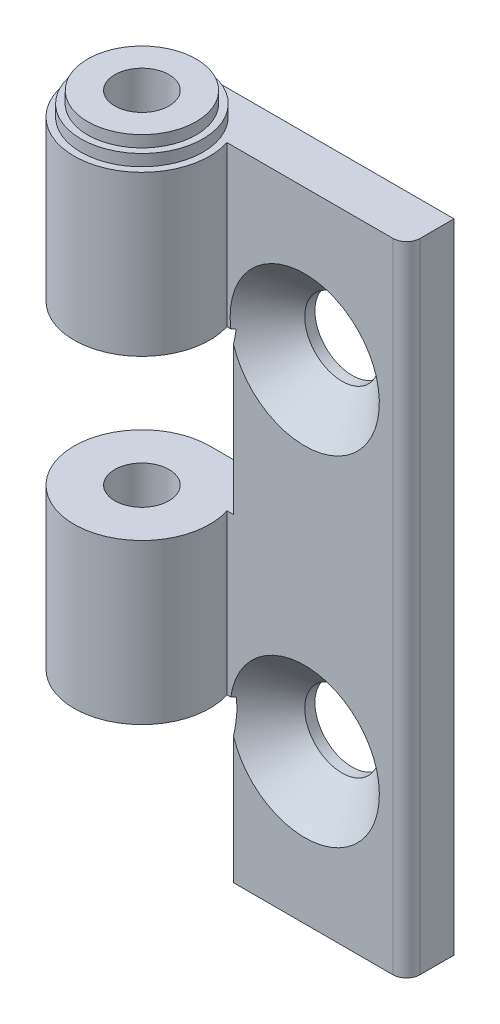
ISO-10303-21;
HEADER;
FILE_DESCRIPTION(('STEP AP214'),'2;1');
FILE_NAME('part.step','',(''),(''),'','','');
FILE_SCHEMA(('AUTOMOTIVE_DESIGN { 1 0 10303 214 1 1 1 1 }'));
ENDSEC;
DATA;
#1=APPLICATION_CONTEXT('core data for automotive mechanical design processes');
#2=APPLICATION_PROTOCOL_DEFINITION('international standard','automotive_design',2000,#1);
#3=PRODUCT_CONTEXT('',#1,'mechanical');
#4=PRODUCT('Part','Part','',(#3));
#5=PRODUCT_RELATED_PRODUCT_CATEGORY('part','',(#4));
#6=PRODUCT_DEFINITION_FORMATION('','',#4);
#7=PRODUCT_DEFINITION_CONTEXT('part definition',#1,'design');
#8=PRODUCT_DEFINITION('design','',#6,#7);
#9=PRODUCT_DEFINITION_SHAPE('','',#8);
#10=(LENGTH_UNIT() NAMED_UNIT(*) SI_UNIT(.MILLI.,.METRE.));
#11=(NAMED_UNIT(*) PLANE_ANGLE_UNIT() SI_UNIT($,.RADIAN.));
#12=(NAMED_UNIT(*) SI_UNIT($,.STERADIAN.) SOLID_ANGLE_UNIT());
#13=UNCERTAINTY_MEASURE_WITH_UNIT(LENGTH_MEASURE(1.E-05),#10,'distance_accuracy_value','');
#14=(GEOMETRIC_REPRESENTATION_CONTEXT(3) GLOBAL_UNCERTAINTY_ASSIGNED_CONTEXT((#13)) GLOBAL_UNIT_ASSIGNED_CONTEXT((#10,
#11,#12)) REPRESENTATION_CONTEXT('',''));
#15=CARTESIAN_POINT('',(0.,0.,0.));
#16=DIRECTION('',(0.,0.,1.));
#17=DIRECTION('',(1.,0.,0.));
#18=AXIS2_PLACEMENT_3D('',#15,#16,#17);
#19=CARTESIAN_POINT('',(0.,23.5,0.));
#20=DIRECTION('',(0.,-1.,0.));
#21=DIRECTION('',(0.,0.,-1.));
#22=AXIS2_PLACEMENT_3D('',#19,#20,#21);
#23=PLANE('',#22);
#24=CARTESIAN_POINT('',(0.,23.5,0.));
#25=DIRECTION('',(0.,-1.,0.));
#26=DIRECTION('',(0.,0.,-1.));
#27=AXIS2_PLACEMENT_3D('',#24,#25,#26);
#28=CIRCLE('',#27,4.5);
#29=CARTESIAN_POINT('',(0.,23.5,-4.5));
#30=VERTEX_POINT('',#29);
#31=EDGE_CURVE('E195',#30,#30,#28,.F.);
#32=ORIENTED_EDGE('',*,*,#31,.F.);
#33=EDGE_LOOP('',(#32));
#34=FACE_BOUND('',#33,.T.);
#35=CARTESIAN_POINT('',(17.0000000000007,23.5,-2.49999999999931));
#36=DIRECTION('',(0.,-1.,0.));
#37=DIRECTION('',(0.,0.,-1.));
#38=AXIS2_PLACEMENT_3D('',#35,#36,#37);
#39=CIRCLE('',#38,0.999999999999304);
#40=CARTESIAN_POINT('',(18.,23.5,-2.5));
#41=VERTEX_POINT('',#40);
#42=CARTESIAN_POINT('',(17.,23.5,-1.5));
#43=VERTEX_POINT('',#42);
#44=EDGE_CURVE('E131',#41,#43,#39,.T.);
#45=ORIENTED_EDGE('',*,*,#44,.F.);
#46=DIRECTION('',(0.,0.,-1.));
#47=VECTOR('',#46,1.);
#48=CARTESIAN_POINT('',(18.,23.5,-1.5));
#49=LINE('',#48,#47);
#50=CARTESIAN_POINT('',(18.,23.5,-5.));
#51=VERTEX_POINT('',#50);
#52=EDGE_CURVE('E152',#41,#51,#49,.T.);
#53=ORIENTED_EDGE('',*,*,#52,.T.);
#54=DIRECTION('',(-1.,0.,0.));
#55=VECTOR('',#54,1.);
#56=CARTESIAN_POINT('',(18.,23.5,-5.));
#57=LINE('',#56,#55);
#58=CARTESIAN_POINT('',(0.,23.5,-5.));
#59=VERTEX_POINT('',#58);
#60=EDGE_CURVE('E160',#51,#59,#57,.T.);
#61=ORIENTED_EDGE('',*,*,#60,.T.);
#62=CARTESIAN_POINT('',(0.,23.5,0.));
#63=DIRECTION('',(0.,1.,0.));
#64=DIRECTION('',(0.,0.,1.));
#65=AXIS2_PLACEMENT_3D('',#62,#63,#64);
#66=CIRCLE('',#65,5.);
#67=CARTESIAN_POINT('',(4.76969600708473,23.5,-1.5));
#68=VERTEX_POINT('',#67);
#69=EDGE_CURVE('E177',#59,#68,#66,.T.);
#70=ORIENTED_EDGE('',*,*,#69,.T.);
#71=DIRECTION('',(-1.,0.,0.));
#72=VECTOR('',#71,1.);
#73=CARTESIAN_POINT('',(18.,23.5,-1.5));
#74=LINE('',#73,#72);
#75=EDGE_CURVE('E153',#43,#68,#74,.T.);
#76=ORIENTED_EDGE('',*,*,#75,.F.);
#77=EDGE_LOOP('',(#45,#53,#61,#70,#76));
#78=FACE_BOUND('',#77,.T.);
#79=ADVANCED_FACE('F32',(#34,#78),#23,.F.);
#80=CARTESIAN_POINT('',(5.,-23.5,0.));
#81=DIRECTION('',(0.,1.,0.));
#82=DIRECTION('',(0.,0.,1.));
#83=AXIS2_PLACEMENT_3D('',#80,#81,#82);
#84=PLANE('',#83);
#85=CARTESIAN_POINT('',(17.0000000000007,-23.5,-2.49999999999931));
#86=DIRECTION('',(0.,-1.,0.));
#87=DIRECTION('',(0.,0.,-1.));
#88=AXIS2_PLACEMENT_3D('',#85,#86,#87);
#89=CIRCLE('',#88,0.999999999999304);
#90=CARTESIAN_POINT('',(18.,-23.5,-2.5));
#91=VERTEX_POINT('',#90);
#92=CARTESIAN_POINT('',(17.,-23.5,-1.5));
#93=VERTEX_POINT('',#92);
#94=EDGE_CURVE('E51',#91,#93,#89,.T.);
#95=ORIENTED_EDGE('',*,*,#94,.T.);
#96=DIRECTION('',(1.,0.,0.));
#97=VECTOR('',#96,1.);
#98=CARTESIAN_POINT('',(0.,-23.5,-1.5));
#99=LINE('',#98,#97);
#100=CARTESIAN_POINT('',(5.25,-23.5,-1.5));
#101=VERTEX_POINT('',#100);
#102=EDGE_CURVE('E143',#101,#93,#99,.T.);
#103=ORIENTED_EDGE('',*,*,#102,.F.);
#104=DIRECTION('',(0.,0.,-1.));
#105=VECTOR('',#104,1.);
#106=CARTESIAN_POINT('',(5.25,-23.5,47.));
#107=LINE('',#106,#105);
#108=CARTESIAN_POINT('',(5.25,-23.5,-5.));
#109=VERTEX_POINT('',#108);
#110=EDGE_CURVE('E251',#101,#109,#107,.T.);
#111=ORIENTED_EDGE('',*,*,#110,.T.);
#112=DIRECTION('',(1.,0.,0.));
#113=VECTOR('',#112,1.);
#114=CARTESIAN_POINT('',(0.,-23.5,-5.));
#115=LINE('',#114,#113);
#116=CARTESIAN_POINT('',(18.,-23.5,-5.));
#117=VERTEX_POINT('',#116);
#118=EDGE_CURVE('E168',#109,#117,#115,.T.);
#119=ORIENTED_EDGE('',*,*,#118,.T.);
#120=DIRECTION('',(0.,0.,-1.));
#121=VECTOR('',#120,1.);
#122=CARTESIAN_POINT('',(18.,-23.5,-1.5));
#123=LINE('',#122,#121);
#124=EDGE_CURVE('E145',#91,#117,#123,.T.);
#125=ORIENTED_EDGE('',*,*,#124,.F.);
#126=EDGE_LOOP('',(#95,#103,#111,#119,#125));
#127=FACE_BOUND('',#126,.T.);
#128=ADVANCED_FACE('F141',(#127),#84,.F.);
#129=CARTESIAN_POINT('',(0.,0.,-1.5));
#130=DIRECTION('',(0.,0.,1.));
#131=DIRECTION('',(1.,0.,0.));
#132=AXIS2_PLACEMENT_3D('',#129,#130,#131);
#133=PLANE('',#132);
#134=DIRECTION('',(0.,-1.,0.));
#135=VECTOR('',#134,1.);
#136=CARTESIAN_POINT('',(17.,23.5,-1.5));
#137=LINE('',#136,#135);
#138=EDGE_CURVE('E128',#43,#93,#137,.T.);
#139=ORIENTED_EDGE('',*,*,#138,.F.);
#140=ORIENTED_EDGE('',*,*,#75,.T.);
#141=DIRECTION('',(0.,1.,0.));
#142=VECTOR('',#141,1.);
#143=CARTESIAN_POINT('',(4.76969600708473,-23.5,-1.5));
#144=LINE('',#143,#142);
#145=CARTESIAN_POINT('',(4.76969600708473,11.75,-1.5));
#146=VERTEX_POINT('',#145);
#147=EDGE_CURVE('E173',#146,#68,#144,.T.);
#148=ORIENTED_EDGE('',*,*,#147,.F.);
#149=DIRECTION('',(-1.,0.,0.));
#150=VECTOR('',#149,1.);
#151=CARTESIAN_POINT('',(0.,11.75,-1.5));
#152=LINE('',#151,#150);
#153=CARTESIAN_POINT('',(5.05137632057416,11.75,-1.5));
#154=VERTEX_POINT('',#153);
#155=EDGE_CURVE('E164',#154,#146,#152,.T.);
#156=ORIENTED_EDGE('',*,*,#155,.F.);
#157=CARTESIAN_POINT('',(10.5,12.5,-1.5));
#158=DIRECTION('',(0.,0.,-1.));
#159=DIRECTION('',(-1.,0.,0.));
#160=AXIS2_PLACEMENT_3D('',#157,#158,#159);
#161=CIRCLE('',#160,5.5);
#162=CARTESIAN_POINT('',(5.25,10.8606403689245,-1.5));
#163=VERTEX_POINT('',#162);
#164=EDGE_CURVE('E135',#154,#163,#161,.T.);
#165=ORIENTED_EDGE('',*,*,#164,.T.);
#166=DIRECTION('',(0.,1.,0.));
#167=VECTOR('',#166,1.);
#168=CARTESIAN_POINT('',(5.25,0.,-1.5));
#169=LINE('',#168,#167);
#170=CARTESIAN_POINT('',(5.25,0.,-1.5));
#171=VERTEX_POINT('',#170);
#172=EDGE_CURVE('E269',#171,#163,#169,.T.);
#173=ORIENTED_EDGE('',*,*,#172,.F.);
#174=DIRECTION('',(1.,0.,0.));
#175=VECTOR('',#174,1.);
#176=CARTESIAN_POINT('',(0.,0.,-1.5));
#177=LINE('',#176,#175);
#178=CARTESIAN_POINT('',(4.76969600708473,0.,-1.5));
#179=VERTEX_POINT('',#178);
#180=EDGE_CURVE('E267',#179,#171,#177,.T.);
#181=ORIENTED_EDGE('',*,*,#180,.F.);
#182=CARTESIAN_POINT('',(4.76969600708473,-11.75,-1.5));
#183=VERTEX_POINT('',#182);
#184=EDGE_CURVE('E176',#183,#179,#144,.T.);
#185=ORIENTED_EDGE('',*,*,#184,.F.);
#186=DIRECTION('',(-1.,0.,0.));
#187=VECTOR('',#186,1.);
#188=CARTESIAN_POINT('',(0.,-11.75,-1.5));
#189=LINE('',#188,#187);
#190=CARTESIAN_POINT('',(5.05137632057416,-11.75,-1.5));
#191=VERTEX_POINT('',#190);
#192=EDGE_CURVE('E263',#191,#183,#189,.T.);
#193=ORIENTED_EDGE('',*,*,#192,.F.);
#194=CARTESIAN_POINT('',(10.5,-12.5,-1.5));
#195=DIRECTION('',(0.,0.,-1.));
#196=DIRECTION('',(-1.,0.,0.));
#197=AXIS2_PLACEMENT_3D('',#194,#195,#196);
#198=CIRCLE('',#197,5.5);
#199=CARTESIAN_POINT('',(5.25,-14.1393596310755,-1.5));
#200=VERTEX_POINT('',#199);
#201=EDGE_CURVE('E310',#191,#200,#198,.T.);
#202=ORIENTED_EDGE('',*,*,#201,.T.);
#203=DIRECTION('',(0.,1.,0.));
#204=VECTOR('',#203,1.);
#205=CARTESIAN_POINT('',(5.25,0.,-1.5));
#206=LINE('',#205,#204);
#207=EDGE_CURVE('E151',#101,#200,#206,.T.);
#208=ORIENTED_EDGE('',*,*,#207,.F.);
#209=ORIENTED_EDGE('',*,*,#102,.T.);
#210=EDGE_LOOP('',(#139,#140,#148,#156,#165,#173,#181,#185,#193,#202,#208,#209));
#211=FACE_BOUND('',#210,.T.);
#212=ADVANCED_FACE('F148',(#211),#133,.T.);
#213=CARTESIAN_POINT('',(0.,0.,-5.));
#214=DIRECTION('',(0.,0.,1.));
#215=DIRECTION('',(1.,0.,0.));
#216=AXIS2_PLACEMENT_3D('',#213,#214,#215);
#217=PLANE('',#216);
#218=CARTESIAN_POINT('',(10.5,-12.5,-5.));
#219=DIRECTION('',(0.,0.,-1.));
#220=DIRECTION('',(-1.,0.,0.));
#221=AXIS2_PLACEMENT_3D('',#218,#219,#220);
#222=CIRCLE('',#221,2.75);
#223=CARTESIAN_POINT('',(7.75,-12.5,-5.));
#224=VERTEX_POINT('',#223);
#225=EDGE_CURVE('E232',#224,#224,#222,.T.);
#226=ORIENTED_EDGE('',*,*,#225,.F.);
#227=EDGE_LOOP('',(#226));
#228=FACE_BOUND('',#227,.T.);
#229=DIRECTION('',(0.,1.,0.));
#230=VECTOR('',#229,1.);
#231=CARTESIAN_POINT('',(5.25,0.,-5.));
#232=LINE('',#231,#230);
#233=CARTESIAN_POINT('',(5.25,0.,-5.));
#234=VERTEX_POINT('',#233);
#235=CARTESIAN_POINT('',(5.25,11.75,-5.));
#236=VERTEX_POINT('',#235);
#237=EDGE_CURVE('E189',#234,#236,#232,.T.);
#238=ORIENTED_EDGE('',*,*,#237,.T.);
#239=DIRECTION('',(-1.,0.,0.));
#240=VECTOR('',#239,1.);
#241=CARTESIAN_POINT('',(0.,11.75,-5.));
#242=LINE('',#241,#240);
#243=CARTESIAN_POINT('',(0.,11.75,-5.));
#244=VERTEX_POINT('',#243);
#245=EDGE_CURVE('E192',#236,#244,#242,.T.);
#246=ORIENTED_EDGE('',*,*,#245,.T.);
#247=DIRECTION('',(0.,-1.,0.));
#248=VECTOR('',#247,1.);
#249=CARTESIAN_POINT('',(0.,23.5,-5.));
#250=LINE('',#249,#248);
#251=EDGE_CURVE('E165',#59,#244,#250,.T.);
#252=ORIENTED_EDGE('',*,*,#251,.F.);
#253=ORIENTED_EDGE('',*,*,#60,.F.);
#254=DIRECTION('',(0.,1.,0.));
#255=VECTOR('',#254,1.);
#256=CARTESIAN_POINT('',(18.,-23.5,-5.));
#257=LINE('',#256,#255);
#258=EDGE_CURVE('E156',#117,#51,#257,.T.);
#259=ORIENTED_EDGE('',*,*,#258,.F.);
#260=ORIENTED_EDGE('',*,*,#118,.F.);
#261=DIRECTION('',(0.,1.,0.));
#262=VECTOR('',#261,1.);
#263=CARTESIAN_POINT('',(5.25,0.,-5.));
#264=LINE('',#263,#262);
#265=CARTESIAN_POINT('',(5.25,-11.75,-5.));
#266=VERTEX_POINT('',#265);
#267=EDGE_CURVE('E180',#109,#266,#264,.T.);
#268=ORIENTED_EDGE('',*,*,#267,.T.);
#269=DIRECTION('',(-1.,0.,0.));
#270=VECTOR('',#269,1.);
#271=CARTESIAN_POINT('',(0.,-11.75,-5.));
#272=LINE('',#271,#270);
#273=CARTESIAN_POINT('',(0.,-11.75,-5.));
#274=VERTEX_POINT('',#273);
#275=EDGE_CURVE('E183',#266,#274,#272,.T.);
#276=ORIENTED_EDGE('',*,*,#275,.T.);
#277=CARTESIAN_POINT('',(0.,0.,-5.));
#278=VERTEX_POINT('',#277);
#279=EDGE_CURVE('E163',#278,#274,#250,.T.);
#280=ORIENTED_EDGE('',*,*,#279,.F.);
#281=DIRECTION('',(1.,0.,0.));
#282=VECTOR('',#281,1.);
#283=CARTESIAN_POINT('',(0.,0.,-5.));
#284=LINE('',#283,#282);
#285=EDGE_CURVE('E186',#278,#234,#284,.T.);
#286=ORIENTED_EDGE('',*,*,#285,.T.);
#287=EDGE_LOOP('',(#238,#246,#252,#253,#259,#260,#268,#276,#280,#286));
#288=FACE_BOUND('',#287,.T.);
#289=CARTESIAN_POINT('',(10.5,12.5,-5.));
#290=DIRECTION('',(0.,0.,-1.));
#291=DIRECTION('',(-1.,0.,0.));
#292=AXIS2_PLACEMENT_3D('',#289,#290,#291);
#293=CIRCLE('',#292,2.75);
#294=CARTESIAN_POINT('',(7.75,12.5,-5.));
#295=VERTEX_POINT('',#294);
#296=EDGE_CURVE('E299',#295,#295,#293,.T.);
#297=ORIENTED_EDGE('',*,*,#296,.F.);
#298=EDGE_LOOP('',(#297));
#299=FACE_BOUND('',#298,.T.);
#300=ADVANCED_FACE('F287',(#228,#288,#299),#217,.F.);
#301=CARTESIAN_POINT('',(-5.,11.75,47.));
#302=DIRECTION('',(0.,1.,0.));
#303=DIRECTION('',(0.,0.,1.));
#304=AXIS2_PLACEMENT_3D('',#301,#302,#303);
#305=PLANE('',#304);
#306=CARTESIAN_POINT('',(0.,11.75,0.));
#307=DIRECTION('',(0.,1.,0.));
#308=DIRECTION('',(0.,0.,1.));
#309=AXIS2_PLACEMENT_3D('',#306,#307,#308);
#310=CIRCLE('',#309,2.);
#311=CARTESIAN_POINT('',(0.,11.75,2.));
#312=VERTEX_POINT('',#311);
#313=EDGE_CURVE('E236',#312,#312,#310,.F.);
#314=ORIENTED_EDGE('',*,*,#313,.F.);
#315=EDGE_LOOP('',(#314));
#316=FACE_BOUND('',#315,.T.);
#317=CARTESIAN_POINT('',(1.70955543510102,11.75,1.82238151796679));
#318=CARTESIAN_POINT('',(2.00511336183713,11.75,1.52790121895714));
#319=CARTESIAN_POINT('',(2.30071768698271,11.75,1.23346743947847));
#320=CARTESIAN_POINT('',(2.89207297914804,11.75,0.644752452085937));
#321=CARTESIAN_POINT('',(3.18782394483944,11.75,0.350471242837695));
#322=CARTESIAN_POINT('',(3.77951995065819,11.75,-0.237872710070981));
#323=CARTESIAN_POINT('',(4.07546498266957,11.75,-0.531935461891403));
#324=CARTESIAN_POINT('',(4.66766681123759,11.75,-1.11975217486902));
#325=CARTESIAN_POINT('',(4.96392361054433,11.75,-1.41350613325588));
#326=CARTESIAN_POINT('',(5.55694165396295,11.75,-2.00054729595557));
#327=CARTESIAN_POINT('',(5.85370293259675,11.75,-2.29383446542827));
#328=CARTESIAN_POINT('',(6.29947573631412,11.75,-2.73311813377528));
#329=CARTESIAN_POINT('',(6.44817005727574,11.75,-2.87943644997767));
#330=CARTESIAN_POINT('',(6.74585437400217,11.75,-3.17177404599918));
#331=CARTESIAN_POINT('',(6.8948443716213,11.75,-3.31779332393114));
#332=CARTESIAN_POINT('',(7.19325465389007,11.75,-3.60941549569947));
#333=CARTESIAN_POINT('',(7.34267497183976,11.75,-3.7550183554738));
#334=CARTESIAN_POINT('',(7.64213307689578,11.75,-4.04558375387482));
#335=CARTESIAN_POINT('',(7.79217085323555,11.75,-4.19054630357592));
#336=CARTESIAN_POINT('',(8.01797725377844,11.75,-4.40722261171559));
#337=CARTESIAN_POINT('',(8.09337438122519,11.75,-4.47932331919674));
#338=CARTESIAN_POINT('',(8.24449480832945,11.75,-4.62318102552218));
#339=CARTESIAN_POINT('',(8.32021810535555,11.75,-4.69493802712951));
#340=CARTESIAN_POINT('',(8.47209696485743,11.75,-4.83800338057768));
#341=CARTESIAN_POINT('',(8.54825255311584,11.75,-4.90931170511226));
#342=CARTESIAN_POINT('',(8.70117025803067,11.75,-5.05127877751312));
#343=CARTESIAN_POINT('',(8.77793239159957,11.75,-5.12193750714687));
#344=CARTESIAN_POINT('',(8.85508506873584,11.75,-5.19217115547523));
#345=B_SPLINE_CURVE_WITH_KNOTS('',3,(#317,#318,#319,#320,#321,#322,#323,#324,#325,#326,#327,
#328,#329,#330,#331,#332,#333,#334,#335,#336,#337,#338,#339,#340,#341,#342,#343,#344),
.UNSPECIFIED.,.F.,.F.,(4,2,2,2,2,2,2,2,2,2,2,2,2,4),(0.,1.25166222359041,2.50331330891406,
3.75491501973666,5.0065278650751,6.25823011578679,6.8840664470222,7.50990671563645,
8.13579679069347,8.76167599801296,9.07464345208767,9.38760838597535,9.70059218600535,
10.0135847440666),.UNSPECIFIED.);
#346=CARTESIAN_POINT('',(5.25,11.75,-1.69669914110089));
#347=VERTEX_POINT('',#346);
#348=EDGE_CURVE('E58',#154,#347,#345,.T.);
#349=ORIENTED_EDGE('',*,*,#348,.F.);
#350=ORIENTED_EDGE('',*,*,#155,.T.);
#351=CARTESIAN_POINT('',(0.,11.75,0.));
#352=DIRECTION('',(0.,1.,0.));
#353=DIRECTION('',(0.,0.,1.));
#354=AXIS2_PLACEMENT_3D('',#351,#352,#353);
#355=CIRCLE('',#354,5.);
#356=EDGE_CURVE('E272',#244,#146,#355,.T.);
#357=ORIENTED_EDGE('',*,*,#356,.F.);
#358=ORIENTED_EDGE('',*,*,#245,.F.);
#359=DIRECTION('',(0.,0.,-1.));
#360=VECTOR('',#359,1.);
#361=CARTESIAN_POINT('',(5.25,11.75,47.));
#362=LINE('',#361,#360);
#363=EDGE_CURVE('E257',#347,#236,#362,.T.);
#364=ORIENTED_EDGE('',*,*,#363,.F.);
#365=EDGE_LOOP('',(#349,#350,#357,#358,#364));
#366=FACE_BOUND('',#365,.T.);
#367=ADVANCED_FACE('F276',(#316,#366),#305,.F.);
#368=CARTESIAN_POINT('',(5.25,11.75,47.));
#369=DIRECTION('',(1.,0.,0.));
#370=DIRECTION('',(0.,0.,-1.));
#371=AXIS2_PLACEMENT_3D('',#368,#369,#370);
#372=PLANE('',#371);
#373=CARTESIAN_POINT('',(5.25,15.043374760015,-1.16636861210091));
#374=CARTESIAN_POINT('',(5.25,14.8598788091006,-1.24636374282738));
#375=CARTESIAN_POINT('',(5.25,14.6735876686936,-1.32058331791124));
#376=CARTESIAN_POINT('',(5.25,14.295135934638,-1.45441037535214));
#377=CARTESIAN_POINT('',(5.25,14.1029570915725,-1.51396584464719));
#378=CARTESIAN_POINT('',(5.25,13.7168830631594,-1.61398342780839));
#379=CARTESIAN_POINT('',(5.25,13.5230657387018,-1.65473840365101));
#380=CARTESIAN_POINT('',(5.25,13.1324209721222,-1.71555623928625));
#381=CARTESIAN_POINT('',(5.25,12.9355982236767,-1.73564856430982));
#382=CARTESIAN_POINT('',(5.25,12.5529353496639,-1.75299935576427));
#383=CARTESIAN_POINT('',(5.25,12.3671552112991,-1.75157207940974));
#384=CARTESIAN_POINT('',(5.25,11.9967259370228,-1.72917665555863));
#385=CARTESIAN_POINT('',(5.25,11.8120772788982,-1.70820075822886));
#386=CARTESIAN_POINT('',(5.25,11.4456535990524,-1.64823303442101));
#387=CARTESIAN_POINT('',(5.25,11.2638807710453,-1.6092280814531));
#388=CARTESIAN_POINT('',(5.25,10.90444794901,-1.51564606968787));
#389=CARTESIAN_POINT('',(5.25,10.7267882067777,-1.46106806024618));
#390=CARTESIAN_POINT('',(5.25,10.3810209214965,-1.34075668311055));
#391=CARTESIAN_POINT('',(5.25,10.2127854487783,-1.27538567033122));
#392=CARTESIAN_POINT('',(5.25,9.88048685213106,-1.1347059304159));
#393=CARTESIAN_POINT('',(5.25,9.71642538437323,-1.05939332978016));
#394=CARTESIAN_POINT('',(5.25,9.3919997339133,-0.900645933851398));
#395=CARTESIAN_POINT('',(5.25,9.23164162138195,-0.817198832905686));
#396=CARTESIAN_POINT('',(5.25,8.91450148099325,-0.64384768720021));
#397=CARTESIAN_POINT('',(5.25,8.75771902493234,-0.553944421006724));
#398=CARTESIAN_POINT('',(5.25,8.44594907909876,-0.368105054508122));
#399=CARTESIAN_POINT('',(5.25,8.29098876611069,-0.272123577050371));
#400=CARTESIAN_POINT('',(5.25,7.98383426852725,-0.0758174911794905));
#401=CARTESIAN_POINT('',(5.25,7.83164034417034,0.0245075228653061));
#402=CARTESIAN_POINT('',(5.25,7.52980251020481,0.228624896147175));
#403=CARTESIAN_POINT('',(5.25,7.38015642956127,0.332414054634259));
#404=CARTESIAN_POINT('',(5.25,7.08295049842695,0.542938566750318));
#405=CARTESIAN_POINT('',(5.25,6.93539069762788,0.649673990376261));
#406=CARTESIAN_POINT('',(5.25,6.6743027159194,0.841891531575016));
#407=CARTESIAN_POINT('',(5.25,6.56041906360289,0.926892046404516));
#408=CARTESIAN_POINT('',(5.25,6.33363884155066,1.09820807814131));
#409=CARTESIAN_POINT('',(5.25,6.22074231454747,1.18452365153808));
#410=CARTESIAN_POINT('',(5.25,5.8858505373797,1.44331999060004));
#411=CARTESIAN_POINT('',(5.25,5.66516123130475,1.61749547866002));
#412=CARTESIAN_POINT('',(5.25,5.44585656014359,1.79337476001502));
#413=B_SPLINE_CURVE_WITH_KNOTS('',3,(#373,#374,#375,#376,#377,#378,#379,#380,#381,#382,#383,
#384,#385,#386,#387,#388,#389,#390,#391,#392,#393,#394,#395,#396,#397,#398,#399,#400,#401,#402,
#403,#404,#405,#406,#407,#408,#409,#410,#411,#412),.UNSPECIFIED.,.F.,.F.,(4,2,2,2,2,2,2,2,2,2,2,
2,2,2,2,2,2,2,2,4),(0.,0.600809730623878,1.20372076851435,1.79689346956178,2.38921912010379,
2.94552461120356,3.50205073728038,4.05898269544795,4.61594865834297,5.15703733504638,
5.69833745961348,6.24046954571015,6.78253636407712,7.32928236963304,7.87607954498961,
8.42238477136081,8.96870298796715,9.39501556582361,9.82134650823017,10.6647083660047),.UNSPECIFIED.);
#414=EDGE_CURVE('E11',#347,#163,#413,.T.);
#415=ORIENTED_EDGE('',*,*,#414,.F.);
#416=ORIENTED_EDGE('',*,*,#363,.T.);
#417=ORIENTED_EDGE('',*,*,#237,.F.);
#418=DIRECTION('',(0.,0.,-1.));
#419=VECTOR('',#418,1.);
#420=CARTESIAN_POINT('',(5.25,0.,47.));
#421=LINE('',#420,#419);
#422=EDGE_CURVE('E255',#171,#234,#421,.T.);
#423=ORIENTED_EDGE('',*,*,#422,.F.);
#424=ORIENTED_EDGE('',*,*,#172,.T.);
#425=EDGE_LOOP('',(#415,#416,#417,#423,#424));
#426=FACE_BOUND('',#425,.T.);
#427=ADVANCED_FACE('F224',(#426),#372,.F.);
#428=CARTESIAN_POINT('',(-5.,-11.75,47.));
#429=DIRECTION('',(0.,1.,0.));
#430=DIRECTION('',(0.,0.,1.));
#431=AXIS2_PLACEMENT_3D('',#428,#429,#430);
#432=PLANE('',#431);
#433=CARTESIAN_POINT('',(0.,-11.75,0.));
#434=DIRECTION('',(0.,1.,0.));
#435=DIRECTION('',(0.,0.,1.));
#436=AXIS2_PLACEMENT_3D('',#433,#434,#435);
#437=CIRCLE('',#436,2.);
#438=CARTESIAN_POINT('',(0.,-11.75,2.));
#439=VERTEX_POINT('',#438);
#440=EDGE_CURVE('E239',#439,#439,#437,.F.);
#441=ORIENTED_EDGE('',*,*,#440,.F.);
#442=EDGE_LOOP('',(#441));
#443=FACE_BOUND('',#442,.T.);
#444=CARTESIAN_POINT('',(1.70955543510103,-11.75,1.82238151796679));
#445=CARTESIAN_POINT('',(2.00511336183713,-11.75,1.52790121895714));
#446=CARTESIAN_POINT('',(2.30071768698271,-11.75,1.23346743947847));
#447=CARTESIAN_POINT('',(2.89207297914804,-11.75,0.644752452085939));
#448=CARTESIAN_POINT('',(3.18782394483944,-11.75,0.350471242837697));
#449=CARTESIAN_POINT('',(3.77951995065819,-11.75,-0.237872710070979));
#450=CARTESIAN_POINT('',(4.07546498266957,-11.75,-0.531935461891402));
#451=CARTESIAN_POINT('',(4.66766681123759,-11.75,-1.11975217486902));
#452=CARTESIAN_POINT('',(4.96392361054433,-11.75,-1.41350613325587));
#453=CARTESIAN_POINT('',(5.55694165396296,-11.75,-2.00054729595557));
#454=CARTESIAN_POINT('',(5.85370293259675,-11.75,-2.29383446542827));
#455=CARTESIAN_POINT('',(6.29947573631412,-11.75,-2.73311813377527));
#456=CARTESIAN_POINT('',(6.44817005727574,-11.75,-2.87943644997767));
#457=CARTESIAN_POINT('',(6.74585437400217,-11.75,-3.17177404599917));
#458=CARTESIAN_POINT('',(6.8948443716213,-11.75,-3.31779332393114));
#459=CARTESIAN_POINT('',(7.19325465389007,-11.75,-3.60941549569947));
#460=CARTESIAN_POINT('',(7.34267497183976,-11.75,-3.7550183554738));
#461=CARTESIAN_POINT('',(7.64213307689578,-11.75,-4.04558375387482));
#462=CARTESIAN_POINT('',(7.79217085323555,-11.75,-4.19054630357592));
#463=CARTESIAN_POINT('',(8.01797725377845,-11.75,-4.40722261171559));
#464=CARTESIAN_POINT('',(8.09337438122519,-11.75,-4.47932331919674));
#465=CARTESIAN_POINT('',(8.24449480832945,-11.75,-4.62318102552218));
#466=CARTESIAN_POINT('',(8.32021810535555,-11.75,-4.69493802712951));
#467=CARTESIAN_POINT('',(8.47209696485743,-11.75,-4.83800338057768));
#468=CARTESIAN_POINT('',(8.54825255311584,-11.75,-4.90931170511226));
#469=CARTESIAN_POINT('',(8.70117025803067,-11.75,-5.05127877751312));
#470=CARTESIAN_POINT('',(8.77793239159957,-11.75,-5.12193750714687));
#471=CARTESIAN_POINT('',(8.85508506873584,-11.75,-5.19217115547523));
#472=B_SPLINE_CURVE_WITH_KNOTS('',3,(#444,#445,#446,#447,#448,#449,#450,#451,#452,#453,#454,
#455,#456,#457,#458,#459,#460,#461,#462,#463,#464,#465,#466,#467,#468,#469,#470,#471),
.UNSPECIFIED.,.F.,.F.,(4,2,2,2,2,2,2,2,2,2,2,2,2,4),(0.,1.25166222359041,2.50331330891406,
3.75491501973666,5.0065278650751,6.25823011578679,6.8840664470222,7.50990671563645,
8.13579679069347,8.76167599801296,9.07464345208767,9.38760838597535,9.70059218600535,
10.0135847440666),.UNSPECIFIED.);
#473=CARTESIAN_POINT('',(5.25,-11.75,-1.69669914110089));
#474=VERTEX_POINT('',#473);
#475=EDGE_CURVE('E201',#191,#474,#472,.T.);
#476=ORIENTED_EDGE('',*,*,#475,.F.);
#477=ORIENTED_EDGE('',*,*,#192,.T.);
#478=CARTESIAN_POINT('',(0.,-11.75,0.));
#479=DIRECTION('',(0.,1.,0.));
#480=DIRECTION('',(0.,0.,1.));
#481=AXIS2_PLACEMENT_3D('',#478,#479,#480);
#482=CIRCLE('',#481,5.);
#483=EDGE_CURVE('E260',#274,#183,#482,.T.);
#484=ORIENTED_EDGE('',*,*,#483,.F.);
#485=ORIENTED_EDGE('',*,*,#275,.F.);
#486=DIRECTION('',(0.,0.,-1.));
#487=VECTOR('',#486,1.);
#488=CARTESIAN_POINT('',(5.25,-11.75,47.));
#489=LINE('',#488,#487);
#490=EDGE_CURVE('E253',#474,#266,#489,.T.);
#491=ORIENTED_EDGE('',*,*,#490,.F.);
#492=EDGE_LOOP('',(#476,#477,#484,#485,#491));
#493=FACE_BOUND('',#492,.T.);
#494=ADVANCED_FACE('F217',(#443,#493),#432,.F.);
#495=CARTESIAN_POINT('',(5.25,-11.75,47.));
#496=DIRECTION('',(1.,0.,0.));
#497=DIRECTION('',(0.,0.,-1.));
#498=AXIS2_PLACEMENT_3D('',#495,#496,#497);
#499=PLANE('',#498);
#500=CARTESIAN_POINT('',(5.25,-25.8623919580027,7.35674123327764));
#501=CARTESIAN_POINT('',(5.25,-25.5626137336878,7.07775431078039));
#502=CARTESIAN_POINT('',(5.25,-25.2622348314231,6.79940893515058));
#503=CARTESIAN_POINT('',(5.25,-24.6599443483124,6.24435217589928));
#504=CARTESIAN_POINT('',(5.25,-24.3580326927076,5.9676408734303));
#505=CARTESIAN_POINT('',(5.25,-23.7516190083526,5.41554257218044));
#506=CARTESIAN_POINT('',(5.25,-23.4471123950247,5.14016060257961));
#507=CARTESIAN_POINT('',(5.25,-22.8358192758521,4.59195225120344));
#508=CARTESIAN_POINT('',(5.25,-22.5290328283057,4.31912580448062));
#509=CARTESIAN_POINT('',(5.25,-21.8817283899343,3.74957202178272));
#510=CARTESIAN_POINT('',(5.25,-21.5409086143133,3.45318675085278));
#511=CARTESIAN_POINT('',(5.25,-20.8547318439957,2.86572825320484));
#512=CARTESIAN_POINT('',(5.25,-20.5093750004774,2.57465485025973));
#513=CARTESIAN_POINT('',(5.25,-19.8130003899511,2.00019879837961));
#514=CARTESIAN_POINT('',(5.25,-19.4619901990289,1.7168070331863));
#515=CARTESIAN_POINT('',(5.25,-18.9292390557611,1.299730863621));
#516=CARTESIAN_POINT('',(5.25,-18.7506281229642,1.16204961418397));
#517=CARTESIAN_POINT('',(5.25,-18.3909264693607,0.889970443138573));
#518=CARTESIAN_POINT('',(5.25,-18.2098358514557,0.755572385925343));
#519=CARTESIAN_POINT('',(5.25,-17.8675172155898,0.507372960308678));
#520=CARTESIAN_POINT('',(5.25,-17.7066344810067,0.393096242524866));
#521=CARTESIAN_POINT('',(5.25,-17.3822302003693,0.16833193462028));
#522=CARTESIAN_POINT('',(5.25,-17.2187086004497,0.0578444219901407));
#523=CARTESIAN_POINT('',(5.25,-16.8883237715757,-0.158634424040429));
#524=CARTESIAN_POINT('',(5.25,-16.721455542761,-0.264618156780691));
#525=CARTESIAN_POINT('',(5.25,-16.3841378108654,-0.470743001046626));
#526=CARTESIAN_POINT('',(5.25,-16.2136884398841,-0.570884327571592));
#527=CARTESIAN_POINT('',(5.25,-15.8724840632604,-0.761683779759998));
#528=CARTESIAN_POINT('',(5.25,-15.7018197045847,-0.852502987671933));
#529=CARTESIAN_POINT('',(5.25,-15.3559985395156,-1.02532056275755));
#530=CARTESIAN_POINT('',(5.25,-15.1808408352576,-1.10731714971377));
#531=CARTESIAN_POINT('',(5.25,-14.8262182629521,-1.25994282228044));
#532=CARTESIAN_POINT('',(5.25,-14.6467679549086,-1.33060539839926));
#533=CARTESIAN_POINT('',(5.25,-14.2830678090215,-1.45807848606592));
#534=CARTESIAN_POINT('',(5.25,-14.098821633356,-1.51489924271618));
#535=CARTESIAN_POINT('',(5.25,-13.782084293395,-1.59718599663946));
#536=CARTESIAN_POINT('',(5.25,-13.6507062586538,-1.62694183136465));
#537=CARTESIAN_POINT('',(5.25,-13.3861763381985,-1.67731645924688));
#538=CARTESIAN_POINT('',(5.25,-13.2530243207689,-1.69793457000352));
#539=CARTESIAN_POINT('',(5.25,-12.9858809940199,-1.729228240621));
#540=CARTESIAN_POINT('',(5.25,-12.8518926044298,-1.73992845799468));
#541=CARTESIAN_POINT('',(5.25,-12.5834855614136,-1.75104903051039));
#542=CARTESIAN_POINT('',(5.25,-12.4490668979801,-1.75146914479104));
#543=CARTESIAN_POINT('',(5.25,-12.1591366770588,-1.74124522513335));
#544=CARTESIAN_POINT('',(5.25,-12.0036857041625,-1.72882307378039));
#545=CARTESIAN_POINT('',(5.25,-11.6944087757623,-1.6907724929208));
#546=CARTESIAN_POINT('',(5.25,-11.5405831515509,-1.66514142209941));
#547=CARTESIAN_POINT('',(5.25,-11.2337549501099,-1.60156607943562));
#548=CARTESIAN_POINT('',(5.25,-11.0807802519785,-1.56348887095436));
#549=CARTESIAN_POINT('',(5.25,-10.7779516046727,-1.47669518444182));
#550=CARTESIAN_POINT('',(5.25,-10.6280970683072,-1.42798072845051));
#551=CARTESIAN_POINT('',(5.25,-10.2976095097308,-1.3092997680713));
#552=CARTESIAN_POINT('',(5.25,-10.1178113625015,-1.23702188717761));
#553=CARTESIAN_POINT('',(5.25,-9.76296966282815,-1.08152260040142));
#554=CARTESIAN_POINT('',(5.25,-9.58792856353423,-0.99829567275951));
#555=CARTESIAN_POINT('',(5.25,-9.24167838148827,-0.82288048403719));
#556=CARTESIAN_POINT('',(5.25,-9.07048443743617,-0.73066257226158));
#557=CARTESIAN_POINT('',(5.25,-8.73206495625704,-0.539321904281687));
#558=CARTESIAN_POINT('',(5.25,-8.56483874549585,-0.440200331577674));
#559=CARTESIAN_POINT('',(5.25,-8.24114131313586,-0.240943534525957));
#560=CARTESIAN_POINT('',(5.25,-8.08452187012098,-0.141047848153065));
#561=CARTESIAN_POINT('',(5.25,-7.77397988266933,0.0628649063309889));
#562=CARTESIAN_POINT('',(5.25,-7.62005755670858,0.166882306110103));
#563=CARTESIAN_POINT('',(5.25,-7.31583631751055,0.377402882532816));
#564=CARTESIAN_POINT('',(5.25,-7.16551784058399,0.48387788893483));
#565=CARTESIAN_POINT('',(5.25,-6.86692709079136,0.699575739841836));
#566=CARTESIAN_POINT('',(5.25,-6.71865425754565,0.808797807709902));
#567=CARTESIAN_POINT('',(5.25,-6.57123395820916,0.919139270040165));
#568=B_SPLINE_CURVE_WITH_KNOTS('',3,(#500,#501,#502,#503,#504,#505,#506,#507,#508,#509,#510,
#511,#512,#513,#514,#515,#516,#517,#518,#519,#520,#521,#522,#523,#524,#525,#526,#527,#528,#529,
#530,#531,#532,#533,#534,#535,#536,#537,#538,#539,#540,#541,#542,#543,#544,#545,#546,#547,#548,
#549,#550,#551,#552,#553,#554,#555,#556,#557,#558,#559,#560,#561,#562,#563,#564,#565,#566,#567),
.UNSPECIFIED.,.F.,.F.,(4,2,2,2,2,2,2,2,2,2,2,2,2,2,2,2,2,2,2,2,2,2,2,2,2,2,2,2,2,2,2,2,2,4),(0.,
1.22854122076119,2.45714294957918,3.68881117849239,4.92044801970411,6.2754045911801,
7.63031612844467,8.98354227110781,9.66006532475632,10.3365603887367,10.9285317235862,
11.5205151572565,12.1134608825752,12.7063847738373,13.2861564817072,13.8660449566678,
14.4441870486378,15.0218999163145,15.4257358574729,15.8296019518061,16.2324612540987,
16.6353299953194,17.1025533626054,17.5698701942436,18.0423510911168,18.5147422519135,
19.0956175152091,19.6767868532281,20.2599421554014,20.842997731685,21.4002175117542,
21.9574822218638,22.5100724595951,23.0625081896345),.UNSPECIFIED.);
#569=EDGE_CURVE('E44',#474,#200,#568,.F.);
#570=ORIENTED_EDGE('',*,*,#569,.F.);
#571=ORIENTED_EDGE('',*,*,#490,.T.);
#572=ORIENTED_EDGE('',*,*,#267,.F.);
#573=ORIENTED_EDGE('',*,*,#110,.F.);
#574=ORIENTED_EDGE('',*,*,#207,.T.);
#575=EDGE_LOOP('',(#570,#571,#572,#573,#574));
#576=FACE_BOUND('',#575,.T.);
#577=ADVANCED_FACE('F211',(#576),#499,.F.);
#578=CARTESIAN_POINT('',(5.25,0.,47.));
#579=DIRECTION('',(0.,-1.,0.));
#580=DIRECTION('',(0.,0.,-1.));
#581=AXIS2_PLACEMENT_3D('',#578,#579,#580);
#582=PLANE('',#581);
#583=ORIENTED_EDGE('',*,*,#180,.T.);
#584=ORIENTED_EDGE('',*,*,#422,.T.);
#585=ORIENTED_EDGE('',*,*,#285,.F.);
#586=CARTESIAN_POINT('',(0.,0.,0.));
#587=DIRECTION('',(0.,-1.,0.));
#588=DIRECTION('',(0.,0.,-1.));
#589=AXIS2_PLACEMENT_3D('',#586,#587,#588);
#590=CIRCLE('',#589,5.);
#591=EDGE_CURVE('E265',#179,#278,#590,.T.);
#592=ORIENTED_EDGE('',*,*,#591,.F.);
#593=EDGE_LOOP('',(#583,#584,#585,#592));
#594=FACE_BOUND('',#593,.T.);
#595=CARTESIAN_POINT('',(0.,0.,0.));
#596=DIRECTION('',(0.,-1.,0.));
#597=DIRECTION('',(0.,0.,-1.));
#598=AXIS2_PLACEMENT_3D('',#595,#596,#597);
#599=CIRCLE('',#598,2.);
#600=CARTESIAN_POINT('',(0.,0.,-2.));
#601=VERTEX_POINT('',#600);
#602=EDGE_CURVE('E200',#601,#601,#599,.F.);
#603=ORIENTED_EDGE('',*,*,#602,.F.);
#604=EDGE_LOOP('',(#603));
#605=FACE_BOUND('',#604,.T.);
#606=ADVANCED_FACE('F216',(#594,#605),#582,.F.);
#607=CARTESIAN_POINT('',(0.,25.2,0.));
#608=DIRECTION('',(0.,-1.,0.));
#609=DIRECTION('',(0.,0.,-1.));
#610=AXIS2_PLACEMENT_3D('',#607,#608,#609);
#611=PLANE('',#610);
#612=CARTESIAN_POINT('',(0.,25.2,0.));
#613=DIRECTION('',(0.,1.,0.));
#614=DIRECTION('',(0.,0.,1.));
#615=AXIS2_PLACEMENT_3D('',#612,#613,#614);
#616=CIRCLE('',#615,4.);
#617=CARTESIAN_POINT('',(0.,25.2,4.));
#618=VERTEX_POINT('',#617);
#619=EDGE_CURVE('E248',#618,#618,#616,.T.);
#620=ORIENTED_EDGE('',*,*,#619,.T.);
#621=EDGE_LOOP('',(#620));
#622=FACE_BOUND('',#621,.T.);
#623=CARTESIAN_POINT('',(0.,25.2,0.));
#624=DIRECTION('',(0.,-1.,0.));
#625=DIRECTION('',(0.,0.,-1.));
#626=AXIS2_PLACEMENT_3D('',#623,#624,#625);
#627=CIRCLE('',#626,2.);
#628=CARTESIAN_POINT('',(0.,25.2,-2.));
#629=VERTEX_POINT('',#628);
#630=EDGE_CURVE('E198',#629,#629,#627,.F.);
#631=ORIENTED_EDGE('',*,*,#630,.F.);
#632=EDGE_LOOP('',(#631));
#633=FACE_BOUND('',#632,.T.);
#634=ADVANCED_FACE('F219',(#622,#633),#611,.F.);
#635=CARTESIAN_POINT('',(0.,-23.5,0.));
#636=DIRECTION('',(0.,1.,0.));
#637=DIRECTION('',(0.,0.,1.));
#638=AXIS2_PLACEMENT_3D('',#635,#636,#637);
#639=CYLINDRICAL_SURFACE('',#638,5.);
#640=ORIENTED_EDGE('',*,*,#356,.T.);
#641=ORIENTED_EDGE('',*,*,#147,.T.);
#642=ORIENTED_EDGE('',*,*,#69,.F.);
#643=ORIENTED_EDGE('',*,*,#251,.T.);
#644=EDGE_LOOP('',(#640,#641,#642,#643));
#645=FACE_BOUND('',#644,.T.);
#646=ADVANCED_FACE('F282',(#645),#639,.T.);
#647=ORIENTED_EDGE('',*,*,#184,.T.);
#648=ORIENTED_EDGE('',*,*,#591,.T.);
#649=ORIENTED_EDGE('',*,*,#279,.T.);
#650=ORIENTED_EDGE('',*,*,#483,.T.);
#651=EDGE_LOOP('',(#647,#648,#649,#650));
#652=FACE_BOUND('',#651,.T.);
#653=ADVANCED_FACE('F357',(#652),#639,.T.);
#654=CARTESIAN_POINT('',(18.,-23.5,-1.5));
#655=DIRECTION('',(-1.,0.,0.));
#656=DIRECTION('',(0.,0.,1.));
#657=AXIS2_PLACEMENT_3D('',#654,#655,#656);
#658=PLANE('',#657);
#659=ORIENTED_EDGE('',*,*,#52,.F.);
#660=DIRECTION('',(0.,-1.,0.));
#661=VECTOR('',#660,1.);
#662=CARTESIAN_POINT('',(18.,23.5,-2.5));
#663=LINE('',#662,#661);
#664=EDGE_CURVE('E136',#41,#91,#663,.T.);
#665=ORIENTED_EDGE('',*,*,#664,.T.);
#666=ORIENTED_EDGE('',*,*,#124,.T.);
#667=ORIENTED_EDGE('',*,*,#258,.T.);
#668=EDGE_LOOP('',(#659,#665,#666,#667));
#669=FACE_BOUND('',#668,.T.);
#670=ADVANCED_FACE('F352',(#669),#658,.F.);
#671=CARTESIAN_POINT('',(0.,23.5,0.));
#672=DIRECTION('',(0.,1.,0.));
#673=DIRECTION('',(0.,0.,1.));
#674=AXIS2_PLACEMENT_3D('',#671,#672,#673);
#675=CYLINDRICAL_SURFACE('',#674,4.);
#676=ORIENTED_EDGE('',*,*,#619,.F.);
#677=EDGE_LOOP('',(#676));
#678=FACE_BOUND('',#677,.T.);
#679=CARTESIAN_POINT('',(0.,24.35,0.));
#680=DIRECTION('',(0.,1.,0.));
#681=DIRECTION('',(0.,0.,1.));
#682=AXIS2_PLACEMENT_3D('',#679,#680,#681);
#683=CIRCLE('',#682,4.);
#684=CARTESIAN_POINT('',(0.,24.35,4.));
#685=VERTEX_POINT('',#684);
#686=EDGE_CURVE('E245',#685,#685,#683,.T.);
#687=ORIENTED_EDGE('',*,*,#686,.T.);
#688=EDGE_LOOP('',(#687));
#689=FACE_BOUND('',#688,.T.);
#690=ADVANCED_FACE('F347',(#678,#689),#675,.T.);
#691=CARTESIAN_POINT('',(4.,24.35,0.));
#692=DIRECTION('',(0.,-1.,0.));
#693=DIRECTION('',(0.,0.,-1.));
#694=AXIS2_PLACEMENT_3D('',#691,#692,#693);
#695=PLANE('',#694);
#696=ORIENTED_EDGE('',*,*,#686,.F.);
#697=EDGE_LOOP('',(#696));
#698=FACE_BOUND('',#697,.T.);
#699=CARTESIAN_POINT('',(0.,24.35,0.));
#700=DIRECTION('',(0.,1.,0.));
#701=DIRECTION('',(0.,0.,1.));
#702=AXIS2_PLACEMENT_3D('',#699,#700,#701);
#703=CIRCLE('',#702,4.5);
#704=CARTESIAN_POINT('',(0.,24.35,4.5));
#705=VERTEX_POINT('',#704);
#706=EDGE_CURVE('E242',#705,#705,#703,.T.);
#707=ORIENTED_EDGE('',*,*,#706,.T.);
#708=EDGE_LOOP('',(#707));
#709=FACE_BOUND('',#708,.T.);
#710=ADVANCED_FACE('F337',(#698,#709),#695,.F.);
#711=CARTESIAN_POINT('',(0.,23.5,0.));
#712=DIRECTION('',(0.,1.,0.));
#713=DIRECTION('',(0.,0.,1.));
#714=AXIS2_PLACEMENT_3D('',#711,#712,#713);
#715=CYLINDRICAL_SURFACE('',#714,4.5);
#716=ORIENTED_EDGE('',*,*,#706,.F.);
#717=EDGE_LOOP('',(#716));
#718=FACE_BOUND('',#717,.T.);
#719=ORIENTED_EDGE('',*,*,#31,.T.);
#720=EDGE_LOOP('',(#719));
#721=FACE_BOUND('',#720,.T.);
#722=ADVANCED_FACE('F334',(#718,#721),#715,.T.);
#723=CARTESIAN_POINT('',(0.,-26.7,0.));
#724=DIRECTION('',(0.,1.,0.));
#725=DIRECTION('',(0.,0.,1.));
#726=AXIS2_PLACEMENT_3D('',#723,#724,#725);
#727=CYLINDRICAL_SURFACE('',#726,2.);
#728=ORIENTED_EDGE('',*,*,#630,.T.);
#729=EDGE_LOOP('',(#728));
#730=FACE_BOUND('',#729,.T.);
#731=ORIENTED_EDGE('',*,*,#313,.T.);
#732=EDGE_LOOP('',(#731));
#733=FACE_BOUND('',#732,.T.);
#734=ADVANCED_FACE('F336',(#730,#733),#727,.F.);
#735=ORIENTED_EDGE('',*,*,#602,.T.);
#736=EDGE_LOOP('',(#735));
#737=FACE_BOUND('',#736,.T.);
#738=ORIENTED_EDGE('',*,*,#440,.T.);
#739=EDGE_LOOP('',(#738));
#740=FACE_BOUND('',#739,.T.);
#741=ADVANCED_FACE('F344',(#737,#740),#727,.F.);
#742=CARTESIAN_POINT('',(10.5,-12.5,-1.5));
#743=DIRECTION('',(0.,0.,1.));
#744=DIRECTION('',(1.,0.,0.));
#745=AXIS2_PLACEMENT_3D('',#742,#743,#744);
#746=CONICAL_SURFACE('',#745,5.5,0.785398163397448);
#747=CARTESIAN_POINT('',(10.5,-12.5,-4.25));
#748=DIRECTION('',(0.,0.,-1.));
#749=DIRECTION('',(-1.,0.,0.));
#750=AXIS2_PLACEMENT_3D('',#747,#748,#749);
#751=CIRCLE('',#750,2.75);
#752=CARTESIAN_POINT('',(7.75,-12.5,-4.25));
#753=VERTEX_POINT('',#752);
#754=EDGE_CURVE('E404',#753,#753,#751,.T.);
#755=ORIENTED_EDGE('',*,*,#754,.T.);
#756=EDGE_LOOP('',(#755));
#757=FACE_BOUND('',#756,.T.);
#758=ORIENTED_EDGE('',*,*,#475,.T.);
#759=ORIENTED_EDGE('',*,*,#569,.T.);
#760=ORIENTED_EDGE('',*,*,#201,.F.);
#761=EDGE_LOOP('',(#758,#759,#760));
#762=FACE_BOUND('',#761,.T.);
#763=ADVANCED_FACE('F207',(#757,#762),#746,.F.);
#764=CARTESIAN_POINT('',(10.5,-12.5,-1.5));
#765=DIRECTION('',(0.,0.,-1.));
#766=DIRECTION('',(-1.,0.,0.));
#767=AXIS2_PLACEMENT_3D('',#764,#765,#766);
#768=CYLINDRICAL_SURFACE('',#767,2.75);
#769=ORIENTED_EDGE('',*,*,#225,.T.);
#770=EDGE_LOOP('',(#769));
#771=FACE_BOUND('',#770,.T.);
#772=ORIENTED_EDGE('',*,*,#754,.F.);
#773=EDGE_LOOP('',(#772));
#774=FACE_BOUND('',#773,.T.);
#775=ADVANCED_FACE('F317',(#771,#774),#768,.F.);
#776=CARTESIAN_POINT('',(10.5,12.5,-1.5));
#777=DIRECTION('',(0.,0.,1.));
#778=DIRECTION('',(1.,0.,0.));
#779=AXIS2_PLACEMENT_3D('',#776,#777,#778);
#780=CONICAL_SURFACE('',#779,5.5,0.785398163397448);
#781=CARTESIAN_POINT('',(10.5,12.5,-4.25));
#782=DIRECTION('',(0.,0.,-1.));
#783=DIRECTION('',(-1.,0.,0.));
#784=AXIS2_PLACEMENT_3D('',#781,#782,#783);
#785=CIRCLE('',#784,2.75);
#786=CARTESIAN_POINT('',(7.75,12.5,-4.25));
#787=VERTEX_POINT('',#786);
#788=EDGE_CURVE('E296',#787,#787,#785,.T.);
#789=ORIENTED_EDGE('',*,*,#788,.T.);
#790=EDGE_LOOP('',(#789));
#791=FACE_BOUND('',#790,.T.);
#792=ORIENTED_EDGE('',*,*,#348,.T.);
#793=ORIENTED_EDGE('',*,*,#414,.T.);
#794=ORIENTED_EDGE('',*,*,#164,.F.);
#795=EDGE_LOOP('',(#792,#793,#794));
#796=FACE_BOUND('',#795,.T.);
#797=ADVANCED_FACE('F294',(#791,#796),#780,.F.);
#798=CARTESIAN_POINT('',(10.5,12.5,-1.5));
#799=DIRECTION('',(0.,0.,-1.));
#800=DIRECTION('',(-1.,0.,0.));
#801=AXIS2_PLACEMENT_3D('',#798,#799,#800);
#802=CYLINDRICAL_SURFACE('',#801,2.75);
#803=ORIENTED_EDGE('',*,*,#296,.T.);
#804=EDGE_LOOP('',(#803));
#805=FACE_BOUND('',#804,.T.);
#806=ORIENTED_EDGE('',*,*,#788,.F.);
#807=EDGE_LOOP('',(#806));
#808=FACE_BOUND('',#807,.T.);
#809=ADVANCED_FACE('F316',(#805,#808),#802,.F.);
#810=CARTESIAN_POINT('',(17.0000000000007,23.5,-2.49999999999931));
#811=DIRECTION('',(0.,-1.,0.));
#812=DIRECTION('',(0.,0.,-1.));
#813=AXIS2_PLACEMENT_3D('',#810,#811,#812);
#814=CYLINDRICAL_SURFACE('',#813,0.999999999999304);
#815=ORIENTED_EDGE('',*,*,#664,.F.);
#816=ORIENTED_EDGE('',*,*,#44,.T.);
#817=ORIENTED_EDGE('',*,*,#138,.T.);
#818=ORIENTED_EDGE('',*,*,#94,.F.);
#819=EDGE_LOOP('',(#815,#816,#817,#818));
#820=FACE_BOUND('',#819,.T.);
#821=ADVANCED_FACE('F129',(#820),#814,.T.);
#822=CLOSED_SHELL('',(#79,#128,#212,#300,#367,#427,#494,#577,#606,#634,#646,#653,#670,#690,#710,
#722,#734,#741,#763,#775,#797,#809,#821));
#823=MANIFOLD_SOLID_BREP('B2',#822);
#824=ADVANCED_BREP_SHAPE_REPRESENTATION('',(#18,#823),#14);
#825=SHAPE_DEFINITION_REPRESENTATION(#9,#824);
ENDSEC;
END-ISO-10303-21;
